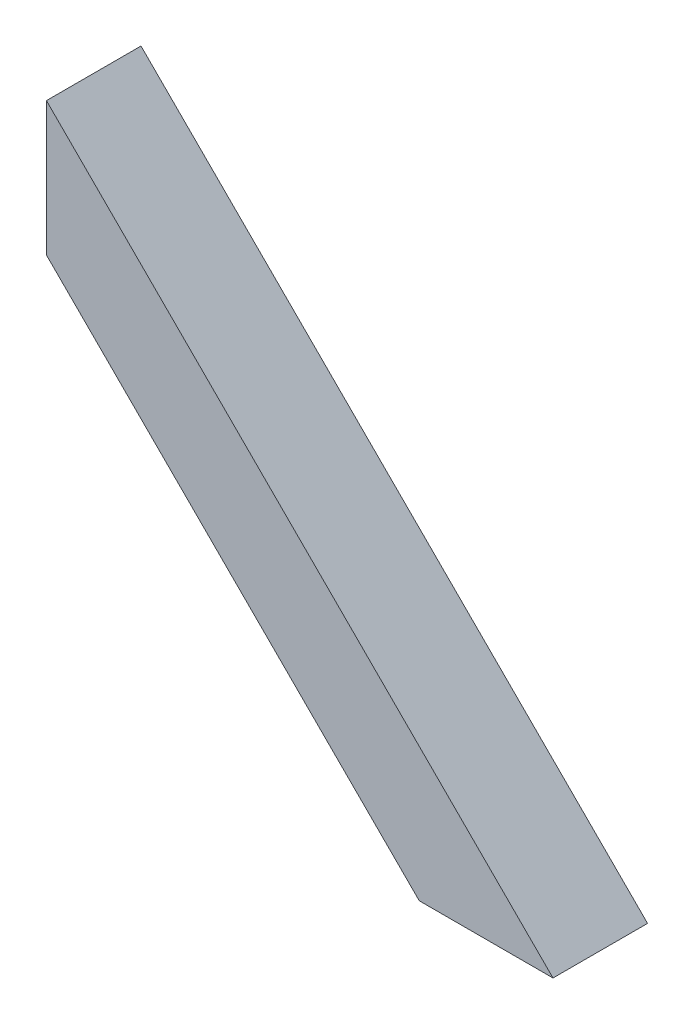
ISO-10303-21;
HEADER;
FILE_DESCRIPTION(('STEP AP214'),'2;1');
FILE_NAME('part.step','',(''),(''),'','','');
FILE_SCHEMA(('AUTOMOTIVE_DESIGN { 1 0 10303 214 1 1 1 1 }'));
ENDSEC;
DATA;
#1=APPLICATION_CONTEXT('core data for automotive mechanical design processes');
#2=APPLICATION_PROTOCOL_DEFINITION('international standard','automotive_design',2000,#1);
#3=PRODUCT_CONTEXT('',#1,'mechanical');
#4=PRODUCT('Part','Part','',(#3));
#5=PRODUCT_RELATED_PRODUCT_CATEGORY('part','',(#4));
#6=PRODUCT_DEFINITION_FORMATION('','',#4);
#7=PRODUCT_DEFINITION_CONTEXT('part definition',#1,'design');
#8=PRODUCT_DEFINITION('design','',#6,#7);
#9=PRODUCT_DEFINITION_SHAPE('','',#8);
#10=(LENGTH_UNIT() NAMED_UNIT(*) SI_UNIT(.MILLI.,.METRE.));
#11=(NAMED_UNIT(*) PLANE_ANGLE_UNIT() SI_UNIT($,.RADIAN.));
#12=(NAMED_UNIT(*) SI_UNIT($,.STERADIAN.) SOLID_ANGLE_UNIT());
#13=UNCERTAINTY_MEASURE_WITH_UNIT(LENGTH_MEASURE(1.E-05),#10,'distance_accuracy_value','');
#14=(GEOMETRIC_REPRESENTATION_CONTEXT(3) GLOBAL_UNCERTAINTY_ASSIGNED_CONTEXT((#13)) GLOBAL_UNIT_ASSIGNED_CONTEXT((#10,
#11,#12)) REPRESENTATION_CONTEXT('',''));
#15=CARTESIAN_POINT('',(0.,0.,0.));
#16=DIRECTION('',(0.,0.,1.));
#17=DIRECTION('',(1.,0.,0.));
#18=AXIS2_PLACEMENT_3D('',#15,#16,#17);
#19=CARTESIAN_POINT('',(108.011511942458,-671.208176729408,-22.225));
#20=DIRECTION('',(0.707106781186547,0.707106781186548,0.));
#21=DIRECTION('',(-0.707106781186548,0.707106781186547,0.));
#22=AXIS2_PLACEMENT_3D('',#19,#20,#21);
#23=PLANE('',#22);
#24=DIRECTION('',(0.707106781186549,-0.707106781186546,0.));
#25=VECTOR('',#24,1.);
#26=CARTESIAN_POINT('',(22.225,-585.42166478695,-19.05));
#27=LINE('',#26,#25);
#28=CARTESIAN_POINT('',(22.225,-585.42166478695,-19.05));
#29=VERTEX_POINT('',#28);
#30=CARTESIAN_POINT('',(201.978335213051,-765.175,-19.05));
#31=VERTEX_POINT('',#30);
#32=EDGE_CURVE('E17',#29,#31,#27,.T.);
#33=ORIENTED_EDGE('',*,*,#32,.F.);
#34=DIRECTION('',(0.,0.,1.));
#35=VECTOR('',#34,1.);
#36=CARTESIAN_POINT('',(22.225,-585.42166478695,-22.225));
#37=LINE('',#36,#35);
#38=CARTESIAN_POINT('',(22.225,-585.42166478695,19.05));
#39=VERTEX_POINT('',#38);
#40=EDGE_CURVE('E95',#29,#39,#37,.T.);
#41=ORIENTED_EDGE('',*,*,#40,.T.);
#42=DIRECTION('',(0.707106781186549,-0.707106781186546,0.));
#43=VECTOR('',#42,1.);
#44=CARTESIAN_POINT('',(22.225,-585.42166478695,19.05));
#45=LINE('',#44,#43);
#46=CARTESIAN_POINT('',(201.978335213051,-765.175,19.05));
#47=VERTEX_POINT('',#46);
#48=EDGE_CURVE('E90',#39,#47,#45,.T.);
#49=ORIENTED_EDGE('',*,*,#48,.T.);
#50=DIRECTION('',(0.,0.,1.));
#51=VECTOR('',#50,1.);
#52=CARTESIAN_POINT('',(201.978335213051,-765.175,-22.225));
#53=LINE('',#52,#51);
#54=EDGE_CURVE('E110',#47,#31,#53,.F.);
#55=ORIENTED_EDGE('',*,*,#54,.T.);
#56=EDGE_LOOP('',(#33,#41,#49,#55));
#57=FACE_BOUND('',#56,.T.);
#58=ADVANCED_FACE('F14',(#57),#23,.T.);
#59=CARTESIAN_POINT('',(-192.0875,-635.,-19.05));
#60=DIRECTION('',(0.,0.,1.));
#61=DIRECTION('',(1.,0.,0.));
#62=AXIS2_PLACEMENT_3D('',#59,#60,#61);
#63=PLANE('',#62);
#64=ORIENTED_EDGE('',*,*,#32,.T.);
#65=DIRECTION('',(1.,0.,0.));
#66=VECTOR('',#65,1.);
#67=CARTESIAN_POINT('',(-192.0875,-765.175,-19.05));
#68=LINE('',#67,#66);
#69=CARTESIAN_POINT('',(255.859871939466,-765.175,-19.05));
#70=VERTEX_POINT('',#69);
#71=EDGE_CURVE('E86',#31,#70,#68,.T.);
#72=ORIENTED_EDGE('',*,*,#71,.T.);
#73=DIRECTION('',(0.707106781186548,-0.707106781186547,0.));
#74=VECTOR('',#73,1.);
#75=CARTESIAN_POINT('',(137.835081776604,-647.150209837139,-19.05));
#76=LINE('',#75,#74);
#77=CARTESIAN_POINT('',(22.225,-531.540128060535,-19.05));
#78=VERTEX_POINT('',#77);
#79=EDGE_CURVE('E82',#78,#70,#76,.T.);
#80=ORIENTED_EDGE('',*,*,#79,.F.);
#81=DIRECTION('',(0.,1.,0.));
#82=VECTOR('',#81,1.);
#83=CARTESIAN_POINT('',(22.225,-540.037512779236,-19.05));
#84=LINE('',#83,#82);
#85=EDGE_CURVE('E84',#78,#29,#84,.F.);
#86=ORIENTED_EDGE('',*,*,#85,.T.);
#87=EDGE_LOOP('',(#64,#72,#80,#86));
#88=FACE_BOUND('',#87,.T.);
#89=ADVANCED_FACE('F83',(#88),#63,.T.);
#90=CARTESIAN_POINT('',(137.835081776604,-647.150209837139,-22.225));
#91=DIRECTION('',(-0.707106781186547,-0.707106781186548,0.));
#92=DIRECTION('',(0.707106781186548,-0.707106781186547,0.));
#93=AXIS2_PLACEMENT_3D('',#90,#91,#92);
#94=PLANE('',#93);
#95=ORIENTED_EDGE('',*,*,#79,.T.);
#96=DIRECTION('',(0.,0.,1.));
#97=VECTOR('',#96,1.);
#98=CARTESIAN_POINT('',(255.859871939466,-765.175,-22.225));
#99=LINE('',#98,#97);
#100=CARTESIAN_POINT('',(255.859871939466,-765.175,19.05));
#101=VERTEX_POINT('',#100);
#102=EDGE_CURVE('E117',#70,#101,#99,.T.);
#103=ORIENTED_EDGE('',*,*,#102,.T.);
#104=DIRECTION('',(-0.707106781186549,0.707106781186546,0.));
#105=VECTOR('',#104,1.);
#106=CARTESIAN_POINT('',(255.859871939466,-765.175,19.0500000000001));
#107=LINE('',#106,#105);
#108=CARTESIAN_POINT('',(22.2249999999999,-531.540128060535,19.05));
#109=VERTEX_POINT('',#108);
#110=EDGE_CURVE('E98',#101,#109,#107,.T.);
#111=ORIENTED_EDGE('',*,*,#110,.T.);
#112=DIRECTION('',(0.,0.,1.));
#113=VECTOR('',#112,1.);
#114=CARTESIAN_POINT('',(22.225,-531.540128060535,-22.225));
#115=LINE('',#114,#113);
#116=EDGE_CURVE('E76',#109,#78,#115,.F.);
#117=ORIENTED_EDGE('',*,*,#116,.T.);
#118=EDGE_LOOP('',(#95,#103,#111,#117));
#119=FACE_BOUND('',#118,.T.);
#120=ADVANCED_FACE('F97',(#119),#94,.T.);
#121=CARTESIAN_POINT('',(-192.0875,-635.,19.05));
#122=DIRECTION('',(0.,0.,1.));
#123=DIRECTION('',(1.,0.,0.));
#124=AXIS2_PLACEMENT_3D('',#121,#122,#123);
#125=PLANE('',#124);
#126=DIRECTION('',(1.,0.,0.));
#127=VECTOR('',#126,1.);
#128=CARTESIAN_POINT('',(-192.0875,-765.175,19.05));
#129=LINE('',#128,#127);
#130=EDGE_CURVE('E113',#101,#47,#129,.F.);
#131=ORIENTED_EDGE('',*,*,#130,.T.);
#132=ORIENTED_EDGE('',*,*,#48,.F.);
#133=DIRECTION('',(0.,1.,0.));
#134=VECTOR('',#133,1.);
#135=CARTESIAN_POINT('',(22.225,-540.037512779236,19.05));
#136=LINE('',#135,#134);
#137=EDGE_CURVE('E138',#39,#109,#136,.T.);
#138=ORIENTED_EDGE('',*,*,#137,.T.);
#139=ORIENTED_EDGE('',*,*,#110,.F.);
#140=EDGE_LOOP('',(#131,#132,#138,#139));
#141=FACE_BOUND('',#140,.T.);
#142=ADVANCED_FACE('F114',(#141),#125,.F.);
#143=CARTESIAN_POINT('',(105.766447912191,-673.453240759675,-22.225));
#144=DIRECTION('',(0.707106781186547,0.707106781186548,0.));
#145=DIRECTION('',(-0.707106781186548,0.707106781186547,0.));
#146=AXIS2_PLACEMENT_3D('',#143,#144,#145);
#147=PLANE('',#146);
#148=DIRECTION('',(0.,0.,1.));
#149=VECTOR('',#148,1.);
#150=CARTESIAN_POINT('',(22.225,-589.911792847485,-22.225));
#151=LINE('',#150,#149);
#152=CARTESIAN_POINT('',(22.2250000000001,-589.911792847485,22.225));
#153=VERTEX_POINT('',#152);
#154=CARTESIAN_POINT('',(22.2250000000001,-589.911792847485,-22.225));
#155=VERTEX_POINT('',#154);
#156=EDGE_CURVE('E100',#153,#155,#151,.F.);
#157=ORIENTED_EDGE('',*,*,#156,.T.);
#158=DIRECTION('',(0.707106781186549,-0.707106781186546,0.));
#159=VECTOR('',#158,1.);
#160=CARTESIAN_POINT('',(22.225,-589.911792847485,-22.225));
#161=LINE('',#160,#159);
#162=CARTESIAN_POINT('',(197.488207152516,-765.175,-22.225));
#163=VERTEX_POINT('',#162);
#164=EDGE_CURVE('E133',#155,#163,#161,.T.);
#165=ORIENTED_EDGE('',*,*,#164,.T.);
#166=DIRECTION('',(0.,0.,1.));
#167=VECTOR('',#166,1.);
#168=CARTESIAN_POINT('',(197.488207152516,-765.175,-22.225));
#169=LINE('',#168,#167);
#170=CARTESIAN_POINT('',(197.488207152516,-765.175,22.225));
#171=VERTEX_POINT('',#170);
#172=EDGE_CURVE('E127',#163,#171,#169,.T.);
#173=ORIENTED_EDGE('',*,*,#172,.T.);
#174=DIRECTION('',(0.707106781186549,-0.707106781186546,0.));
#175=VECTOR('',#174,1.);
#176=CARTESIAN_POINT('',(22.225,-589.911792847485,22.225));
#177=LINE('',#176,#175);
#178=EDGE_CURVE('E120',#153,#171,#177,.T.);
#179=ORIENTED_EDGE('',*,*,#178,.F.);
#180=EDGE_LOOP('',(#157,#165,#173,#179));
#181=FACE_BOUND('',#180,.T.);
#182=ADVANCED_FACE('F160',(#181),#147,.F.);
#183=CARTESIAN_POINT('',(22.225,-540.037512779236,-22.225));
#184=DIRECTION('',(1.,0.,0.));
#185=DIRECTION('',(0.,1.,0.));
#186=AXIS2_PLACEMENT_3D('',#183,#184,#185);
#187=PLANE('',#186);
#188=ORIENTED_EDGE('',*,*,#40,.F.);
#189=ORIENTED_EDGE('',*,*,#85,.F.);
#190=ORIENTED_EDGE('',*,*,#116,.F.);
#191=ORIENTED_EDGE('',*,*,#137,.F.);
#192=EDGE_LOOP('',(#188,#189,#190,#191));
#193=FACE_BOUND('',#192,.T.);
#194=DIRECTION('',(0.,0.,1.));
#195=VECTOR('',#194,1.);
#196=CARTESIAN_POINT('',(22.2249999999995,-527.050000000001,-22.225));
#197=LINE('',#196,#195);
#198=CARTESIAN_POINT('',(22.2249999999998,-527.05,22.225));
#199=VERTEX_POINT('',#198);
#200=CARTESIAN_POINT('',(22.2249999999999,-527.05,-22.225));
#201=VERTEX_POINT('',#200);
#202=EDGE_CURVE('E141',#199,#201,#197,.F.);
#203=ORIENTED_EDGE('',*,*,#202,.T.);
#204=DIRECTION('',(0.,1.,0.));
#205=VECTOR('',#204,1.);
#206=CARTESIAN_POINT('',(22.225,-635.,-22.225));
#207=LINE('',#206,#205);
#208=EDGE_CURVE('E135',#201,#155,#207,.F.);
#209=ORIENTED_EDGE('',*,*,#208,.T.);
#210=ORIENTED_EDGE('',*,*,#156,.F.);
#211=DIRECTION('',(0.,1.,0.));
#212=VECTOR('',#211,1.);
#213=CARTESIAN_POINT('',(22.225,-635.,22.225));
#214=LINE('',#213,#212);
#215=EDGE_CURVE('E116',#199,#153,#214,.F.);
#216=ORIENTED_EDGE('',*,*,#215,.F.);
#217=EDGE_LOOP('',(#203,#209,#210,#216));
#218=FACE_BOUND('',#217,.T.);
#219=ADVANCED_FACE('F92',(#193,#218),#187,.F.);
#220=CARTESIAN_POINT('',(-192.0875,-635.,-22.225));
#221=DIRECTION('',(0.,0.,1.));
#222=DIRECTION('',(1.,0.,0.));
#223=AXIS2_PLACEMENT_3D('',#220,#221,#222);
#224=PLANE('',#223);
#225=DIRECTION('',(1.,0.,0.));
#226=VECTOR('',#225,1.);
#227=CARTESIAN_POINT('',(-192.0875,-765.175,-22.225));
#228=LINE('',#227,#226);
#229=CARTESIAN_POINT('',(260.35,-765.175,-22.225));
#230=VERTEX_POINT('',#229);
#231=EDGE_CURVE('E130',#230,#163,#228,.F.);
#232=ORIENTED_EDGE('',*,*,#231,.T.);
#233=ORIENTED_EDGE('',*,*,#164,.F.);
#234=ORIENTED_EDGE('',*,*,#208,.F.);
#235=DIRECTION('',(0.707106781186548,-0.707106781186547,0.));
#236=VECTOR('',#235,1.);
#237=CARTESIAN_POINT('',(140.080145806871,-644.905145806872,-22.225));
#238=LINE('',#237,#236);
#239=EDGE_CURVE('E147',#201,#230,#238,.T.);
#240=ORIENTED_EDGE('',*,*,#239,.T.);
#241=EDGE_LOOP('',(#232,#233,#234,#240));
#242=FACE_BOUND('',#241,.T.);
#243=ADVANCED_FACE('F146',(#242),#224,.F.);
#244=CARTESIAN_POINT('',(-192.0875,-765.175,-22.225));
#245=DIRECTION('',(0.,1.,0.));
#246=DIRECTION('',(0.,0.,1.));
#247=AXIS2_PLACEMENT_3D('',#244,#245,#246);
#248=PLANE('',#247);
#249=ORIENTED_EDGE('',*,*,#102,.F.);
#250=ORIENTED_EDGE('',*,*,#71,.F.);
#251=ORIENTED_EDGE('',*,*,#54,.F.);
#252=ORIENTED_EDGE('',*,*,#130,.F.);
#253=EDGE_LOOP('',(#249,#250,#251,#252));
#254=FACE_BOUND('',#253,.T.);
#255=ORIENTED_EDGE('',*,*,#172,.F.);
#256=ORIENTED_EDGE('',*,*,#231,.F.);
#257=DIRECTION('',(0.,0.,1.));
#258=VECTOR('',#257,1.);
#259=CARTESIAN_POINT('',(260.35,-765.175,-22.225));
#260=LINE('',#259,#258);
#261=CARTESIAN_POINT('',(260.35,-765.175,22.225));
#262=VERTEX_POINT('',#261);
#263=EDGE_CURVE('E23',#230,#262,#260,.T.);
#264=ORIENTED_EDGE('',*,*,#263,.T.);
#265=DIRECTION('',(1.,0.,0.));
#266=VECTOR('',#265,1.);
#267=CARTESIAN_POINT('',(-192.0875,-765.175,22.225));
#268=LINE('',#267,#266);
#269=EDGE_CURVE('E31',#171,#262,#268,.T.);
#270=ORIENTED_EDGE('',*,*,#269,.F.);
#271=EDGE_LOOP('',(#255,#256,#264,#270));
#272=FACE_BOUND('',#271,.T.);
#273=ADVANCED_FACE('F162',(#254,#272),#248,.F.);
#274=CARTESIAN_POINT('',(-192.0875,-635.,22.225));
#275=DIRECTION('',(0.,0.,1.));
#276=DIRECTION('',(1.,0.,0.));
#277=AXIS2_PLACEMENT_3D('',#274,#275,#276);
#278=PLANE('',#277);
#279=ORIENTED_EDGE('',*,*,#178,.T.);
#280=ORIENTED_EDGE('',*,*,#269,.T.);
#281=DIRECTION('',(0.707106781186548,-0.707106781186547,0.));
#282=VECTOR('',#281,1.);
#283=CARTESIAN_POINT('',(140.080145806871,-644.905145806872,22.225));
#284=LINE('',#283,#282);
#285=EDGE_CURVE('E9',#262,#199,#284,.F.);
#286=ORIENTED_EDGE('',*,*,#285,.T.);
#287=ORIENTED_EDGE('',*,*,#215,.T.);
#288=EDGE_LOOP('',(#279,#280,#286,#287));
#289=FACE_BOUND('',#288,.T.);
#290=ADVANCED_FACE('F157',(#289),#278,.T.);
#291=CARTESIAN_POINT('',(140.080145806871,-644.905145806872,-22.225));
#292=DIRECTION('',(-0.707106781186547,-0.707106781186548,0.));
#293=DIRECTION('',(0.707106781186548,-0.707106781186547,0.));
#294=AXIS2_PLACEMENT_3D('',#291,#292,#293);
#295=PLANE('',#294);
#296=ORIENTED_EDGE('',*,*,#263,.F.);
#297=ORIENTED_EDGE('',*,*,#239,.F.);
#298=ORIENTED_EDGE('',*,*,#202,.F.);
#299=ORIENTED_EDGE('',*,*,#285,.F.);
#300=EDGE_LOOP('',(#296,#297,#298,#299));
#301=FACE_BOUND('',#300,.T.);
#302=ADVANCED_FACE('F150',(#301),#295,.F.);
#303=CLOSED_SHELL('',(#58,#89,#120,#142,#182,#219,#243,#273,#290,#302));
#304=MANIFOLD_SOLID_BREP('B1',#303);
#305=ADVANCED_BREP_SHAPE_REPRESENTATION('',(#18,#304),#14);
#306=SHAPE_DEFINITION_REPRESENTATION(#9,#305);
ENDSEC;
END-ISO-10303-21;
